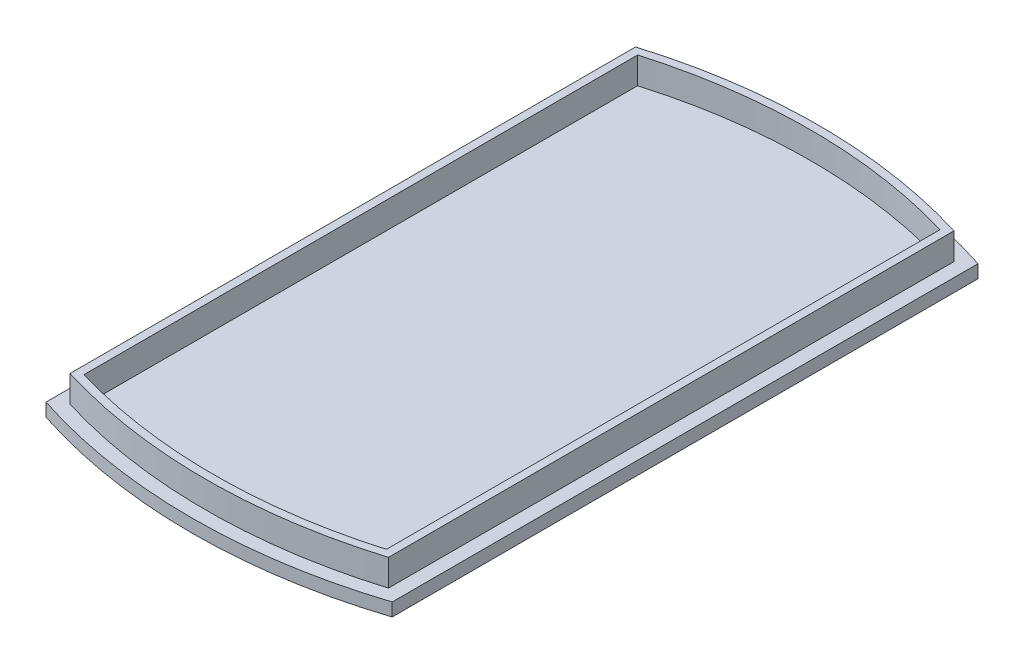
ISO-10303-21;
HEADER;
FILE_DESCRIPTION(('STEP AP214'),'2;1');
FILE_NAME('part.step','',(''),(''),'','','');
FILE_SCHEMA(('AUTOMOTIVE_DESIGN { 1 0 10303 214 1 1 1 1 }'));
ENDSEC;
DATA;
#1=APPLICATION_CONTEXT('core data for automotive mechanical design processes');
#2=APPLICATION_PROTOCOL_DEFINITION('international standard','automotive_design',2000,#1);
#3=PRODUCT_CONTEXT('',#1,'mechanical');
#4=PRODUCT('Part','Part','',(#3));
#5=PRODUCT_RELATED_PRODUCT_CATEGORY('part','',(#4));
#6=PRODUCT_DEFINITION_FORMATION('','',#4);
#7=PRODUCT_DEFINITION_CONTEXT('part definition',#1,'design');
#8=PRODUCT_DEFINITION('design','',#6,#7);
#9=PRODUCT_DEFINITION_SHAPE('','',#8);
#10=(LENGTH_UNIT() NAMED_UNIT(*) SI_UNIT(.MILLI.,.METRE.));
#11=(NAMED_UNIT(*) PLANE_ANGLE_UNIT() SI_UNIT($,.RADIAN.));
#12=(NAMED_UNIT(*) SI_UNIT($,.STERADIAN.) SOLID_ANGLE_UNIT());
#13=UNCERTAINTY_MEASURE_WITH_UNIT(LENGTH_MEASURE(1.E-05),#10,'distance_accuracy_value','');
#14=(GEOMETRIC_REPRESENTATION_CONTEXT(3) GLOBAL_UNCERTAINTY_ASSIGNED_CONTEXT((#13)) GLOBAL_UNIT_ASSIGNED_CONTEXT((#10,
#11,#12)) REPRESENTATION_CONTEXT('',''));
#15=CARTESIAN_POINT('',(0.,0.,0.));
#16=DIRECTION('',(0.,0.,1.));
#17=DIRECTION('',(1.,0.,0.));
#18=AXIS2_PLACEMENT_3D('',#15,#16,#17);
#19=CARTESIAN_POINT('',(0.,7.,-44.8436277385793));
#20=DIRECTION('',(0.,-1.,0.));
#21=DIRECTION('',(0.,0.,-1.));
#22=AXIS2_PLACEMENT_3D('',#19,#20,#21);
#23=PLANE('',#22);
#24=CARTESIAN_POINT('',(0.,7.,-44.8436277385793));
#25=DIRECTION('',(0.,1.,0.));
#26=DIRECTION('',(0.,0.,-1.));
#27=AXIS2_PLACEMENT_3D('',#24,#25,#26);
#28=CIRCLE('',#27,105.);
#29=CARTESIAN_POINT('',(-32.5,7.,55.));
#30=VERTEX_POINT('',#29);
#31=CARTESIAN_POINT('',(32.5,7.,55.));
#32=VERTEX_POINT('',#31);
#33=EDGE_CURVE('E221',#30,#32,#28,.T.);
#34=ORIENTED_EDGE('',*,*,#33,.T.);
#35=DIRECTION('',(0.,0.,-1.));
#36=VECTOR('',#35,1.);
#37=CARTESIAN_POINT('',(32.5,7.,-55.));
#38=LINE('',#37,#36);
#39=CARTESIAN_POINT('',(32.5,7.,-55.));
#40=VERTEX_POINT('',#39);
#41=EDGE_CURVE('E224',#32,#40,#38,.T.);
#42=ORIENTED_EDGE('',*,*,#41,.T.);
#43=CARTESIAN_POINT('',(0.,7.,44.8436277385793));
#44=DIRECTION('',(0.,1.,0.));
#45=DIRECTION('',(0.,0.,1.));
#46=AXIS2_PLACEMENT_3D('',#43,#44,#45);
#47=CIRCLE('',#46,105.);
#48=CARTESIAN_POINT('',(-32.5,7.,-55.));
#49=VERTEX_POINT('',#48);
#50=EDGE_CURVE('E226',#40,#49,#47,.T.);
#51=ORIENTED_EDGE('',*,*,#50,.T.);
#52=DIRECTION('',(0.,0.,1.));
#53=VECTOR('',#52,1.);
#54=CARTESIAN_POINT('',(-32.5,7.,-55.));
#55=LINE('',#54,#53);
#56=EDGE_CURVE('E228',#49,#30,#55,.T.);
#57=ORIENTED_EDGE('',*,*,#56,.T.);
#58=EDGE_LOOP('',(#34,#42,#51,#57));
#59=FACE_BOUND('',#58,.T.);
#60=CARTESIAN_POINT('',(0.,7.,-44.8436277385793));
#61=DIRECTION('',(0.,1.,0.));
#62=DIRECTION('',(0.,0.,1.));
#63=AXIS2_PLACEMENT_3D('',#60,#61,#62);
#64=CIRCLE('',#63,102.4);
#65=CARTESIAN_POINT('',(-29.9,7.,53.0938523188533));
#66=VERTEX_POINT('',#65);
#67=CARTESIAN_POINT('',(29.9,7.,53.0938523188533));
#68=VERTEX_POINT('',#67);
#69=EDGE_CURVE('E165',#66,#68,#64,.T.);
#70=ORIENTED_EDGE('',*,*,#69,.F.);
#71=DIRECTION('',(0.,0.,1.));
#72=VECTOR('',#71,1.);
#73=CARTESIAN_POINT('',(-29.9,7.,-53.0938523188533));
#74=LINE('',#73,#72);
#75=CARTESIAN_POINT('',(-29.9,7.,-53.0938523188533));
#76=VERTEX_POINT('',#75);
#77=EDGE_CURVE('E193',#76,#66,#74,.T.);
#78=ORIENTED_EDGE('',*,*,#77,.F.);
#79=CARTESIAN_POINT('',(0.,7.,44.8436277385793));
#80=DIRECTION('',(0.,1.,0.));
#81=DIRECTION('',(0.,0.,1.));
#82=AXIS2_PLACEMENT_3D('',#79,#80,#81);
#83=CIRCLE('',#82,102.4);
#84=CARTESIAN_POINT('',(29.9,7.,-53.0938523188533));
#85=VERTEX_POINT('',#84);
#86=EDGE_CURVE('E205',#85,#76,#83,.T.);
#87=ORIENTED_EDGE('',*,*,#86,.F.);
#88=DIRECTION('',(0.,0.,-1.));
#89=VECTOR('',#88,1.);
#90=CARTESIAN_POINT('',(29.9,7.,53.0938523188533));
#91=LINE('',#90,#89);
#92=EDGE_CURVE('E202',#68,#85,#91,.T.);
#93=ORIENTED_EDGE('',*,*,#92,.F.);
#94=EDGE_LOOP('',(#70,#78,#87,#93));
#95=FACE_BOUND('',#94,.T.);
#96=ADVANCED_FACE('F36',(#59,#95),#23,.F.);
#97=CARTESIAN_POINT('',(0.,7.,-44.8436277385793));
#98=DIRECTION('',(0.,-1.,0.));
#99=DIRECTION('',(0.,0.,-1.));
#100=AXIS2_PLACEMENT_3D('',#97,#98,#99);
#101=CYLINDRICAL_SURFACE('',#100,105.);
#102=DIRECTION('',(0.,-1.,0.));
#103=VECTOR('',#102,1.);
#104=CARTESIAN_POINT('',(-32.5,7.,55.));
#105=LINE('',#104,#103);
#106=CARTESIAN_POINT('',(-32.5,4.54962792832754,55.));
#107=VERTEX_POINT('',#106);
#108=EDGE_CURVE('E230',#30,#107,#105,.T.);
#109=ORIENTED_EDGE('',*,*,#108,.T.);
#110=CARTESIAN_POINT('',(0.,4.54962792832754,-44.8436277385793));
#111=DIRECTION('',(0.,-1.,0.));
#112=DIRECTION('',(0.,0.,-1.));
#113=AXIS2_PLACEMENT_3D('',#110,#111,#112);
#114=CIRCLE('',#113,105.);
#115=CARTESIAN_POINT('',(32.5,4.54962792832754,55.));
#116=VERTEX_POINT('',#115);
#117=EDGE_CURVE('E239',#107,#116,#114,.F.);
#118=ORIENTED_EDGE('',*,*,#117,.T.);
#119=DIRECTION('',(0.,-1.,0.));
#120=VECTOR('',#119,1.);
#121=CARTESIAN_POINT('',(32.5,7.,55.));
#122=LINE('',#121,#120);
#123=EDGE_CURVE('E237',#32,#116,#122,.T.);
#124=ORIENTED_EDGE('',*,*,#123,.F.);
#125=ORIENTED_EDGE('',*,*,#33,.F.);
#126=EDGE_LOOP('',(#109,#118,#124,#125));
#127=FACE_BOUND('',#126,.T.);
#128=ADVANCED_FACE('F295',(#127),#101,.T.);
#129=CARTESIAN_POINT('',(32.5,7.,-55.));
#130=DIRECTION('',(-1.,0.,0.));
#131=DIRECTION('',(0.,0.,1.));
#132=AXIS2_PLACEMENT_3D('',#129,#130,#131);
#133=PLANE('',#132);
#134=ORIENTED_EDGE('',*,*,#123,.T.);
#135=DIRECTION('',(0.,0.,-1.));
#136=VECTOR('',#135,1.);
#137=CARTESIAN_POINT('',(32.5,4.54962792832754,-55.));
#138=LINE('',#137,#136);
#139=CARTESIAN_POINT('',(32.5,4.54962792832754,-55.));
#140=VERTEX_POINT('',#139);
#141=EDGE_CURVE('E66',#116,#140,#138,.T.);
#142=ORIENTED_EDGE('',*,*,#141,.T.);
#143=DIRECTION('',(0.,-1.,0.));
#144=VECTOR('',#143,1.);
#145=CARTESIAN_POINT('',(32.5,7.,-55.));
#146=LINE('',#145,#144);
#147=EDGE_CURVE('E235',#40,#140,#146,.T.);
#148=ORIENTED_EDGE('',*,*,#147,.F.);
#149=ORIENTED_EDGE('',*,*,#41,.F.);
#150=EDGE_LOOP('',(#134,#142,#148,#149));
#151=FACE_BOUND('',#150,.T.);
#152=ADVANCED_FACE('F301',(#151),#133,.F.);
#153=CARTESIAN_POINT('',(0.,7.,44.8436277385793));
#154=DIRECTION('',(0.,-1.,0.));
#155=DIRECTION('',(0.,0.,-1.));
#156=AXIS2_PLACEMENT_3D('',#153,#154,#155);
#157=CYLINDRICAL_SURFACE('',#156,105.);
#158=ORIENTED_EDGE('',*,*,#147,.T.);
#159=CARTESIAN_POINT('',(0.,4.54962792832754,44.8436277385793));
#160=DIRECTION('',(0.,-1.,0.));
#161=DIRECTION('',(0.,0.,-1.));
#162=AXIS2_PLACEMENT_3D('',#159,#160,#161);
#163=CIRCLE('',#162,105.);
#164=CARTESIAN_POINT('',(-32.5,4.54962792832754,-55.));
#165=VERTEX_POINT('',#164);
#166=EDGE_CURVE('E51',#140,#165,#163,.F.);
#167=ORIENTED_EDGE('',*,*,#166,.T.);
#168=DIRECTION('',(0.,-1.,0.));
#169=VECTOR('',#168,1.);
#170=CARTESIAN_POINT('',(-32.5,7.,-55.));
#171=LINE('',#170,#169);
#172=EDGE_CURVE('E233',#49,#165,#171,.T.);
#173=ORIENTED_EDGE('',*,*,#172,.F.);
#174=ORIENTED_EDGE('',*,*,#50,.F.);
#175=EDGE_LOOP('',(#158,#167,#173,#174));
#176=FACE_BOUND('',#175,.T.);
#177=ADVANCED_FACE('F409',(#176),#157,.T.);
#178=CARTESIAN_POINT('',(-32.5,7.,-55.));
#179=DIRECTION('',(1.,0.,0.));
#180=DIRECTION('',(0.,0.,-1.));
#181=AXIS2_PLACEMENT_3D('',#178,#179,#180);
#182=PLANE('',#181);
#183=ORIENTED_EDGE('',*,*,#172,.T.);
#184=DIRECTION('',(0.,0.,1.));
#185=VECTOR('',#184,1.);
#186=CARTESIAN_POINT('',(-32.5,4.54962792832754,55.));
#187=LINE('',#186,#185);
#188=EDGE_CURVE('E11',#165,#107,#187,.T.);
#189=ORIENTED_EDGE('',*,*,#188,.T.);
#190=ORIENTED_EDGE('',*,*,#108,.F.);
#191=ORIENTED_EDGE('',*,*,#56,.F.);
#192=EDGE_LOOP('',(#183,#189,#190,#191));
#193=FACE_BOUND('',#192,.T.);
#194=ADVANCED_FACE('F418',(#193),#182,.F.);
#195=CARTESIAN_POINT('',(0.,0.,-44.8436277385793));
#196=DIRECTION('',(0.,-1.,0.));
#197=DIRECTION('',(0.,0.,-1.));
#198=AXIS2_PLACEMENT_3D('',#195,#196,#197);
#199=PLANE('',#198);
#200=DIRECTION('',(0.,0.,1.));
#201=VECTOR('',#200,1.);
#202=CARTESIAN_POINT('',(19.9999999999999,0.,55.));
#203=LINE('',#202,#201);
#204=CARTESIAN_POINT('',(19.9999999999999,0.,-45.4683316023628));
#205=VERTEX_POINT('',#204);
#206=CARTESIAN_POINT('',(19.9999999999999,0.,45.4683316023628));
#207=VERTEX_POINT('',#206);
#208=EDGE_CURVE('E246',#205,#207,#203,.T.);
#209=ORIENTED_EDGE('',*,*,#208,.T.);
#210=CARTESIAN_POINT('',(0.,0.,-44.8436277385793));
#211=DIRECTION('',(0.,-1.,0.));
#212=DIRECTION('',(0.,0.,-1.));
#213=AXIS2_PLACEMENT_3D('',#210,#211,#212);
#214=CIRCLE('',#213,92.4999999999999);
#215=CARTESIAN_POINT('',(-19.9999999999999,0.,45.4683316023628));
#216=VERTEX_POINT('',#215);
#217=EDGE_CURVE('E248',#207,#216,#214,.T.);
#218=ORIENTED_EDGE('',*,*,#217,.T.);
#219=DIRECTION('',(0.,0.,-1.));
#220=VECTOR('',#219,1.);
#221=CARTESIAN_POINT('',(-19.9999999999999,0.,-55.));
#222=LINE('',#221,#220);
#223=CARTESIAN_POINT('',(-19.9999999999999,0.,-45.4683316023628));
#224=VERTEX_POINT('',#223);
#225=EDGE_CURVE('E242',#216,#224,#222,.T.);
#226=ORIENTED_EDGE('',*,*,#225,.T.);
#227=CARTESIAN_POINT('',(0.,0.,44.8436277385793));
#228=DIRECTION('',(0.,-1.,0.));
#229=DIRECTION('',(0.,0.,-1.));
#230=AXIS2_PLACEMENT_3D('',#227,#228,#229);
#231=CIRCLE('',#230,92.4999999999999);
#232=EDGE_CURVE('E244',#224,#205,#231,.T.);
#233=ORIENTED_EDGE('',*,*,#232,.T.);
#234=EDGE_LOOP('',(#209,#218,#226,#233));
#235=FACE_BOUND('',#234,.T.);
#236=ADVANCED_FACE('F331',(#235),#199,.T.);
#237=CARTESIAN_POINT('',(0.,12.,-44.8436277385793));
#238=DIRECTION('',(0.,1.,0.));
#239=DIRECTION('',(0.,0.,1.));
#240=AXIS2_PLACEMENT_3D('',#237,#238,#239);
#241=PLANE('',#240);
#242=CARTESIAN_POINT('',(0.,12.,-44.8436277385793));
#243=DIRECTION('',(0.,1.,0.));
#244=DIRECTION('',(0.,0.,1.));
#245=AXIS2_PLACEMENT_3D('',#242,#243,#244);
#246=CIRCLE('',#245,102.4);
#247=CARTESIAN_POINT('',(-29.9,12.,53.0938523188533));
#248=VERTEX_POINT('',#247);
#249=CARTESIAN_POINT('',(29.9,12.,53.0938523188533));
#250=VERTEX_POINT('',#249);
#251=EDGE_CURVE('E189',#248,#250,#246,.T.);
#252=ORIENTED_EDGE('',*,*,#251,.T.);
#253=DIRECTION('',(0.,0.,-1.));
#254=VECTOR('',#253,1.);
#255=CARTESIAN_POINT('',(29.9,12.,53.0938523188533));
#256=LINE('',#255,#254);
#257=CARTESIAN_POINT('',(29.9,12.,-53.0938523188533));
#258=VERTEX_POINT('',#257);
#259=EDGE_CURVE('E192',#250,#258,#256,.T.);
#260=ORIENTED_EDGE('',*,*,#259,.T.);
#261=CARTESIAN_POINT('',(0.,12.,44.8436277385793));
#262=DIRECTION('',(0.,1.,0.));
#263=DIRECTION('',(0.,0.,1.));
#264=AXIS2_PLACEMENT_3D('',#261,#262,#263);
#265=CIRCLE('',#264,102.4);
#266=CARTESIAN_POINT('',(-29.9,12.,-53.0938523188533));
#267=VERTEX_POINT('',#266);
#268=EDGE_CURVE('E195',#258,#267,#265,.T.);
#269=ORIENTED_EDGE('',*,*,#268,.T.);
#270=DIRECTION('',(0.,0.,1.));
#271=VECTOR('',#270,1.);
#272=CARTESIAN_POINT('',(-29.9,12.,-53.0938523188533));
#273=LINE('',#272,#271);
#274=EDGE_CURVE('E197',#267,#248,#273,.T.);
#275=ORIENTED_EDGE('',*,*,#274,.T.);
#276=EDGE_LOOP('',(#252,#260,#269,#275));
#277=FACE_BOUND('',#276,.T.);
#278=DIRECTION('',(0.,0.,-1.));
#279=VECTOR('',#278,1.);
#280=CARTESIAN_POINT('',(28.4,12.,51.9770828557972));
#281=LINE('',#280,#279);
#282=CARTESIAN_POINT('',(28.4,12.,51.9770828557972));
#283=VERTEX_POINT('',#282);
#284=CARTESIAN_POINT('',(28.4,12.,-51.9770828557972));
#285=VERTEX_POINT('',#284);
#286=EDGE_CURVE('E157',#283,#285,#281,.T.);
#287=ORIENTED_EDGE('',*,*,#286,.F.);
#288=CARTESIAN_POINT('',(0.,12.,-44.8436277385793));
#289=DIRECTION('',(0.,1.,0.));
#290=DIRECTION('',(0.,0.,1.));
#291=AXIS2_PLACEMENT_3D('',#288,#289,#290);
#292=CIRCLE('',#291,100.9);
#293=CARTESIAN_POINT('',(-28.4,12.,51.9770828557972));
#294=VERTEX_POINT('',#293);
#295=EDGE_CURVE('E147',#294,#283,#292,.T.);
#296=ORIENTED_EDGE('',*,*,#295,.F.);
#297=DIRECTION('',(0.,0.,1.));
#298=VECTOR('',#297,1.);
#299=CARTESIAN_POINT('',(-28.4,12.,-51.9770828557972));
#300=LINE('',#299,#298);
#301=CARTESIAN_POINT('',(-28.4,12.,-51.9770828557972));
#302=VERTEX_POINT('',#301);
#303=EDGE_CURVE('E173',#302,#294,#300,.T.);
#304=ORIENTED_EDGE('',*,*,#303,.F.);
#305=CARTESIAN_POINT('',(0.,12.,44.8436277385793));
#306=DIRECTION('',(0.,1.,0.));
#307=DIRECTION('',(0.,0.,1.));
#308=AXIS2_PLACEMENT_3D('',#305,#306,#307);
#309=CIRCLE('',#308,100.9);
#310=EDGE_CURVE('E171',#285,#302,#309,.T.);
#311=ORIENTED_EDGE('',*,*,#310,.F.);
#312=EDGE_LOOP('',(#287,#296,#304,#311));
#313=FACE_BOUND('',#312,.T.);
#314=ADVANCED_FACE('F169',(#277,#313),#241,.T.);
#315=CARTESIAN_POINT('',(0.,12.,-44.8436277385793));
#316=DIRECTION('',(0.,-1.,0.));
#317=DIRECTION('',(0.,0.,-1.));
#318=AXIS2_PLACEMENT_3D('',#315,#316,#317);
#319=CYLINDRICAL_SURFACE('',#318,102.4);
#320=ORIENTED_EDGE('',*,*,#69,.T.);
#321=DIRECTION('',(0.,-1.,0.));
#322=VECTOR('',#321,1.);
#323=CARTESIAN_POINT('',(29.9,12.,53.0938523188533));
#324=LINE('',#323,#322);
#325=EDGE_CURVE('E218',#250,#68,#324,.T.);
#326=ORIENTED_EDGE('',*,*,#325,.F.);
#327=ORIENTED_EDGE('',*,*,#251,.F.);
#328=DIRECTION('',(0.,-1.,0.));
#329=VECTOR('',#328,1.);
#330=CARTESIAN_POINT('',(-29.9,12.,53.0938523188533));
#331=LINE('',#330,#329);
#332=EDGE_CURVE('E199',#248,#66,#331,.T.);
#333=ORIENTED_EDGE('',*,*,#332,.T.);
#334=EDGE_LOOP('',(#320,#326,#327,#333));
#335=FACE_BOUND('',#334,.T.);
#336=ADVANCED_FACE('F330',(#335),#319,.T.);
#337=CARTESIAN_POINT('',(29.9,12.,53.0938523188533));
#338=DIRECTION('',(-1.,0.,0.));
#339=DIRECTION('',(0.,0.,1.));
#340=AXIS2_PLACEMENT_3D('',#337,#338,#339);
#341=PLANE('',#340);
#342=ORIENTED_EDGE('',*,*,#92,.T.);
#343=DIRECTION('',(0.,-1.,0.));
#344=VECTOR('',#343,1.);
#345=CARTESIAN_POINT('',(29.9,12.,-53.0938523188533));
#346=LINE('',#345,#344);
#347=EDGE_CURVE('E215',#258,#85,#346,.T.);
#348=ORIENTED_EDGE('',*,*,#347,.F.);
#349=ORIENTED_EDGE('',*,*,#259,.F.);
#350=ORIENTED_EDGE('',*,*,#325,.T.);
#351=EDGE_LOOP('',(#342,#348,#349,#350));
#352=FACE_BOUND('',#351,.T.);
#353=ADVANCED_FACE('F339',(#352),#341,.F.);
#354=CARTESIAN_POINT('',(0.,12.,44.8436277385793));
#355=DIRECTION('',(0.,-1.,0.));
#356=DIRECTION('',(0.,0.,-1.));
#357=AXIS2_PLACEMENT_3D('',#354,#355,#356);
#358=CYLINDRICAL_SURFACE('',#357,102.4);
#359=ORIENTED_EDGE('',*,*,#86,.T.);
#360=DIRECTION('',(0.,-1.,0.));
#361=VECTOR('',#360,1.);
#362=CARTESIAN_POINT('',(-29.9,12.,-53.0938523188533));
#363=LINE('',#362,#361);
#364=EDGE_CURVE('E212',#267,#76,#363,.T.);
#365=ORIENTED_EDGE('',*,*,#364,.F.);
#366=ORIENTED_EDGE('',*,*,#268,.F.);
#367=ORIENTED_EDGE('',*,*,#347,.T.);
#368=EDGE_LOOP('',(#359,#365,#366,#367));
#369=FACE_BOUND('',#368,.T.);
#370=ADVANCED_FACE('F335',(#369),#358,.T.);
#371=CARTESIAN_POINT('',(-29.9,12.,-53.0938523188533));
#372=DIRECTION('',(1.,0.,0.));
#373=DIRECTION('',(0.,0.,-1.));
#374=AXIS2_PLACEMENT_3D('',#371,#372,#373);
#375=PLANE('',#374);
#376=ORIENTED_EDGE('',*,*,#77,.T.);
#377=ORIENTED_EDGE('',*,*,#332,.F.);
#378=ORIENTED_EDGE('',*,*,#274,.F.);
#379=ORIENTED_EDGE('',*,*,#364,.T.);
#380=EDGE_LOOP('',(#376,#377,#378,#379));
#381=FACE_BOUND('',#380,.T.);
#382=ADVANCED_FACE('F327',(#381),#375,.F.);
#383=CARTESIAN_POINT('',(0.,12.,-44.8436277385793));
#384=DIRECTION('',(0.,-1.,0.));
#385=DIRECTION('',(0.,0.,-1.));
#386=AXIS2_PLACEMENT_3D('',#383,#384,#385);
#387=CYLINDRICAL_SURFACE('',#386,100.9);
#388=CARTESIAN_POINT('',(0.,7.,-44.8436277385793));
#389=DIRECTION('',(0.,1.,0.));
#390=DIRECTION('',(0.,0.,1.));
#391=AXIS2_PLACEMENT_3D('',#388,#389,#390);
#392=CIRCLE('',#391,100.9);
#393=CARTESIAN_POINT('',(-28.4,7.,51.9770828557972));
#394=VERTEX_POINT('',#393);
#395=CARTESIAN_POINT('',(28.4,7.,51.9770828557972));
#396=VERTEX_POINT('',#395);
#397=EDGE_CURVE('E177',#394,#396,#392,.T.);
#398=ORIENTED_EDGE('',*,*,#397,.F.);
#399=DIRECTION('',(0.,-1.,0.));
#400=VECTOR('',#399,1.);
#401=CARTESIAN_POINT('',(-28.4,12.,51.9770828557972));
#402=LINE('',#401,#400);
#403=EDGE_CURVE('E153',#294,#394,#402,.T.);
#404=ORIENTED_EDGE('',*,*,#403,.F.);
#405=ORIENTED_EDGE('',*,*,#295,.T.);
#406=DIRECTION('',(0.,-1.,0.));
#407=VECTOR('',#406,1.);
#408=CARTESIAN_POINT('',(28.4,12.,51.9770828557972));
#409=LINE('',#408,#407);
#410=EDGE_CURVE('E151',#283,#396,#409,.T.);
#411=ORIENTED_EDGE('',*,*,#410,.T.);
#412=EDGE_LOOP('',(#398,#404,#405,#411));
#413=FACE_BOUND('',#412,.T.);
#414=ADVANCED_FACE('F150',(#413),#387,.F.);
#415=CARTESIAN_POINT('',(28.4,12.,51.9770828557972));
#416=DIRECTION('',(-1.,0.,0.));
#417=DIRECTION('',(0.,0.,1.));
#418=AXIS2_PLACEMENT_3D('',#415,#416,#417);
#419=PLANE('',#418);
#420=DIRECTION('',(0.,0.,-1.));
#421=VECTOR('',#420,1.);
#422=CARTESIAN_POINT('',(28.4,7.,51.9770828557972));
#423=LINE('',#422,#421);
#424=CARTESIAN_POINT('',(28.4,7.,-51.9770828557972));
#425=VERTEX_POINT('',#424);
#426=EDGE_CURVE('E164',#396,#425,#423,.T.);
#427=ORIENTED_EDGE('',*,*,#426,.F.);
#428=ORIENTED_EDGE('',*,*,#410,.F.);
#429=ORIENTED_EDGE('',*,*,#286,.T.);
#430=DIRECTION('',(0.,-1.,0.));
#431=VECTOR('',#430,1.);
#432=CARTESIAN_POINT('',(28.4,12.,-51.9770828557972));
#433=LINE('',#432,#431);
#434=EDGE_CURVE('E166',#285,#425,#433,.T.);
#435=ORIENTED_EDGE('',*,*,#434,.T.);
#436=EDGE_LOOP('',(#427,#428,#429,#435));
#437=FACE_BOUND('',#436,.T.);
#438=ADVANCED_FACE('F161',(#437),#419,.T.);
#439=CARTESIAN_POINT('',(0.,12.,44.8436277385793));
#440=DIRECTION('',(0.,-1.,0.));
#441=DIRECTION('',(0.,0.,-1.));
#442=AXIS2_PLACEMENT_3D('',#439,#440,#441);
#443=CYLINDRICAL_SURFACE('',#442,100.9);
#444=CARTESIAN_POINT('',(0.,7.,44.8436277385793));
#445=DIRECTION('',(0.,1.,0.));
#446=DIRECTION('',(0.,0.,1.));
#447=AXIS2_PLACEMENT_3D('',#444,#445,#446);
#448=CIRCLE('',#447,100.9);
#449=CARTESIAN_POINT('',(-28.4,7.,-51.9770828557972));
#450=VERTEX_POINT('',#449);
#451=EDGE_CURVE('E180',#425,#450,#448,.T.);
#452=ORIENTED_EDGE('',*,*,#451,.F.);
#453=ORIENTED_EDGE('',*,*,#434,.F.);
#454=ORIENTED_EDGE('',*,*,#310,.T.);
#455=DIRECTION('',(0.,-1.,0.));
#456=VECTOR('',#455,1.);
#457=CARTESIAN_POINT('',(-28.4,12.,-51.9770828557972));
#458=LINE('',#457,#456);
#459=EDGE_CURVE('E186',#302,#450,#458,.T.);
#460=ORIENTED_EDGE('',*,*,#459,.T.);
#461=EDGE_LOOP('',(#452,#453,#454,#460));
#462=FACE_BOUND('',#461,.T.);
#463=ADVANCED_FACE('F312',(#462),#443,.F.);
#464=CARTESIAN_POINT('',(-28.4,12.,-51.9770828557972));
#465=DIRECTION('',(1.,0.,0.));
#466=DIRECTION('',(0.,0.,-1.));
#467=AXIS2_PLACEMENT_3D('',#464,#465,#466);
#468=PLANE('',#467);
#469=DIRECTION('',(0.,0.,1.));
#470=VECTOR('',#469,1.);
#471=CARTESIAN_POINT('',(-28.4,7.,-51.9770828557972));
#472=LINE('',#471,#470);
#473=EDGE_CURVE('E158',#450,#394,#472,.T.);
#474=ORIENTED_EDGE('',*,*,#473,.F.);
#475=ORIENTED_EDGE('',*,*,#459,.F.);
#476=ORIENTED_EDGE('',*,*,#303,.T.);
#477=ORIENTED_EDGE('',*,*,#403,.T.);
#478=EDGE_LOOP('',(#474,#475,#476,#477));
#479=FACE_BOUND('',#478,.T.);
#480=ADVANCED_FACE('F307',(#479),#468,.T.);
#481=ORIENTED_EDGE('',*,*,#473,.T.);
#482=ORIENTED_EDGE('',*,*,#397,.T.);
#483=ORIENTED_EDGE('',*,*,#426,.T.);
#484=ORIENTED_EDGE('',*,*,#451,.T.);
#485=EDGE_LOOP('',(#481,#482,#483,#484));
#486=FACE_BOUND('',#485,.T.);
#487=ADVANCED_FACE('F291',(#486),#23,.F.);
#488=CARTESIAN_POINT('',(0.,4.54962792832754,44.8436277385793));
#489=DIRECTION('',(0.,1.,0.));
#490=DIRECTION('',(0.,0.,1.));
#491=AXIS2_PLACEMENT_3D('',#488,#489,#490);
#492=CONICAL_SURFACE('',#491,105.,1.22173047639603);
#493=CARTESIAN_POINT('',(32.5,4.54962792832754,-55.));
#494=CARTESIAN_POINT('',(31.4413128688093,4.16429732517347,-54.231239399036));
#495=CARTESIAN_POINT('',(30.3864944791188,3.78037482876952,-53.4564299199023));
#496=CARTESIAN_POINT('',(28.2852897234907,3.01559884162231,-51.8943042834771));
#497=CARTESIAN_POINT('',(27.2389021917057,2.63474492654528,-51.1069899017507));
#498=CARTESIAN_POINT('',(25.1549331585313,1.87624222933728,-49.5192125045828));
#499=CARTESIAN_POINT('',(24.1173518454279,1.4985935157368,-48.7187492090727));
#500=CARTESIAN_POINT('',(22.0514987667225,0.746684486720836,-47.1040130415574));
#501=CARTESIAN_POINT('',(21.02322833229,0.372424655811449,-46.2897382412934));
#502=CARTESIAN_POINT('',(19.9999999999999,0.,-45.4683316023628));
#503=B_SPLINE_CURVE_WITH_KNOTS('',3,(#493,#494,#495,#496,#497,#498,#499,#500,#501,#502),
.UNSPECIFIED.,.F.,.F.,(4,2,2,2,4),(0.,4.0917672904179,8.18295869646158,12.274237357107,
16.3660919912094),.UNSPECIFIED.);
#504=EDGE_CURVE('E484',#205,#140,#503,.F.);
#505=ORIENTED_EDGE('',*,*,#504,.F.);
#506=ORIENTED_EDGE('',*,*,#232,.F.);
#507=CARTESIAN_POINT('',(-32.5,4.54962792832754,-55.));
#508=CARTESIAN_POINT('',(-31.4413128688094,4.16429732517347,-54.231239399036));
#509=CARTESIAN_POINT('',(-30.3864944791189,3.78037482876952,-53.4564299199023));
#510=CARTESIAN_POINT('',(-28.2852897234908,3.01559884162231,-51.8943042834771));
#511=CARTESIAN_POINT('',(-27.2389021917057,2.63474492654528,-51.1069899017507));
#512=CARTESIAN_POINT('',(-25.1549331585313,1.87624222933728,-49.5192125045828));
#513=CARTESIAN_POINT('',(-24.1173518454279,1.4985935157368,-48.7187492090727));
#514=CARTESIAN_POINT('',(-22.0514987667225,0.746684486720841,-47.1040130415574));
#515=CARTESIAN_POINT('',(-21.02322833229,0.372424655811454,-46.2897382412934));
#516=CARTESIAN_POINT('',(-19.9999999999999,0.,-45.4683316023628));
#517=B_SPLINE_CURVE_WITH_KNOTS('',3,(#507,#508,#509,#510,#511,#512,#513,#514,#515,#516),
.UNSPECIFIED.,.F.,.F.,(4,2,2,2,4),(0.,4.09176729041789,8.18295869646157,12.274237357107,
16.3660919912094),.UNSPECIFIED.);
#518=EDGE_CURVE('E42',#165,#224,#517,.T.);
#519=ORIENTED_EDGE('',*,*,#518,.F.);
#520=ORIENTED_EDGE('',*,*,#166,.F.);
#521=EDGE_LOOP('',(#505,#506,#519,#520));
#522=FACE_BOUND('',#521,.T.);
#523=ADVANCED_FACE('F39',(#522),#492,.T.);
#524=CARTESIAN_POINT('',(-32.5,4.54962792832754,-55.));
#525=DIRECTION('',(-0.342020143325667,-0.939692620785909,0.));
#526=DIRECTION('',(0.,0.,-1.));
#527=AXIS2_PLACEMENT_3D('',#524,#525,#526);
#528=PLANE('',#527);
#529=ORIENTED_EDGE('',*,*,#518,.T.);
#530=ORIENTED_EDGE('',*,*,#225,.F.);
#531=CARTESIAN_POINT('',(-19.9999999999999,0.,45.4683316023628));
#532=CARTESIAN_POINT('',(-21.02322833229,0.372424655811453,46.2897382412934));
#533=CARTESIAN_POINT('',(-22.0514987667225,0.746684486720841,47.1040130415574));
#534=CARTESIAN_POINT('',(-24.1173518454279,1.4985935157368,48.7187492090727));
#535=CARTESIAN_POINT('',(-25.1549331585313,1.87624222933728,49.5192125045828));
#536=CARTESIAN_POINT('',(-27.2389021917057,2.63474492654528,51.1069899017508));
#537=CARTESIAN_POINT('',(-28.2852897234907,3.01559884162231,51.8943042834771));
#538=CARTESIAN_POINT('',(-30.3864944791189,3.78037482876953,53.4564299199023));
#539=CARTESIAN_POINT('',(-31.4413128688094,4.16429732517347,54.231239399036));
#540=CARTESIAN_POINT('',(-32.5,4.54962792832754,55.));
#541=B_SPLINE_CURVE_WITH_KNOTS('',3,(#531,#532,#533,#534,#535,#536,#537,#538,#539,#540),
.UNSPECIFIED.,.F.,.F.,(4,2,2,2,4),(0.,4.09185463410245,8.18313329474788,12.2743247007916,
16.3660919912094),.UNSPECIFIED.);
#542=EDGE_CURVE('E261',#107,#216,#541,.F.);
#543=ORIENTED_EDGE('',*,*,#542,.F.);
#544=ORIENTED_EDGE('',*,*,#188,.F.);
#545=EDGE_LOOP('',(#529,#530,#543,#544));
#546=FACE_BOUND('',#545,.T.);
#547=ADVANCED_FACE('F278',(#546),#528,.T.);
#548=CARTESIAN_POINT('',(32.5,4.54962792832754,-55.));
#549=DIRECTION('',(0.342020143325666,-0.939692620785909,0.));
#550=DIRECTION('',(0.,0.,1.));
#551=AXIS2_PLACEMENT_3D('',#548,#549,#550);
#552=PLANE('',#551);
#553=ORIENTED_EDGE('',*,*,#504,.T.);
#554=ORIENTED_EDGE('',*,*,#141,.F.);
#555=CARTESIAN_POINT('',(32.5,4.54962792832754,55.));
#556=CARTESIAN_POINT('',(31.4413128688094,4.16429732517347,54.231239399036));
#557=CARTESIAN_POINT('',(30.3864944791189,3.78037482876952,53.4564299199023));
#558=CARTESIAN_POINT('',(28.2852897234908,3.01559884162231,51.8943042834771));
#559=CARTESIAN_POINT('',(27.2389021917057,2.63474492654528,51.1069899017507));
#560=CARTESIAN_POINT('',(25.1549331585313,1.87624222933728,49.5192125045828));
#561=CARTESIAN_POINT('',(24.1173518454279,1.4985935157368,48.7187492090727));
#562=CARTESIAN_POINT('',(22.0514987667225,0.746684486720841,47.1040130415574));
#563=CARTESIAN_POINT('',(21.02322833229,0.372424655811454,46.2897382412934));
#564=CARTESIAN_POINT('',(19.9999999999999,0.,45.4683316023628));
#565=B_SPLINE_CURVE_WITH_KNOTS('',3,(#555,#556,#557,#558,#559,#560,#561,#562,#563,#564),
.UNSPECIFIED.,.F.,.F.,(4,2,2,2,4),(0.,4.0917672904179,8.18295869646157,12.274237357107,
16.3660919912094),.UNSPECIFIED.);
#566=EDGE_CURVE('E253',#207,#116,#565,.F.);
#567=ORIENTED_EDGE('',*,*,#566,.F.);
#568=ORIENTED_EDGE('',*,*,#208,.F.);
#569=EDGE_LOOP('',(#553,#554,#567,#568));
#570=FACE_BOUND('',#569,.T.);
#571=ADVANCED_FACE('F267',(#570),#552,.T.);
#572=CARTESIAN_POINT('',(0.,4.54962792832754,-44.8436277385793));
#573=DIRECTION('',(0.,1.,0.));
#574=DIRECTION('',(0.,0.,1.));
#575=AXIS2_PLACEMENT_3D('',#572,#573,#574);
#576=CONICAL_SURFACE('',#575,105.,1.22173047639603);
#577=ORIENTED_EDGE('',*,*,#542,.T.);
#578=ORIENTED_EDGE('',*,*,#217,.F.);
#579=ORIENTED_EDGE('',*,*,#566,.T.);
#580=ORIENTED_EDGE('',*,*,#117,.F.);
#581=EDGE_LOOP('',(#577,#578,#579,#580));
#582=FACE_BOUND('',#581,.T.);
#583=ADVANCED_FACE('F271',(#582),#576,.T.);
#584=CLOSED_SHELL('',(#96,#128,#152,#177,#194,#236,#314,#336,#353,#370,#382,#414,#438,#463,#480,
#487,#523,#547,#571,#583));
#585=MANIFOLD_SOLID_BREP('B2',#584);
#586=ADVANCED_BREP_SHAPE_REPRESENTATION('',(#18,#585),#14);
#587=SHAPE_DEFINITION_REPRESENTATION(#9,#586);
ENDSEC;
END-ISO-10303-21;
